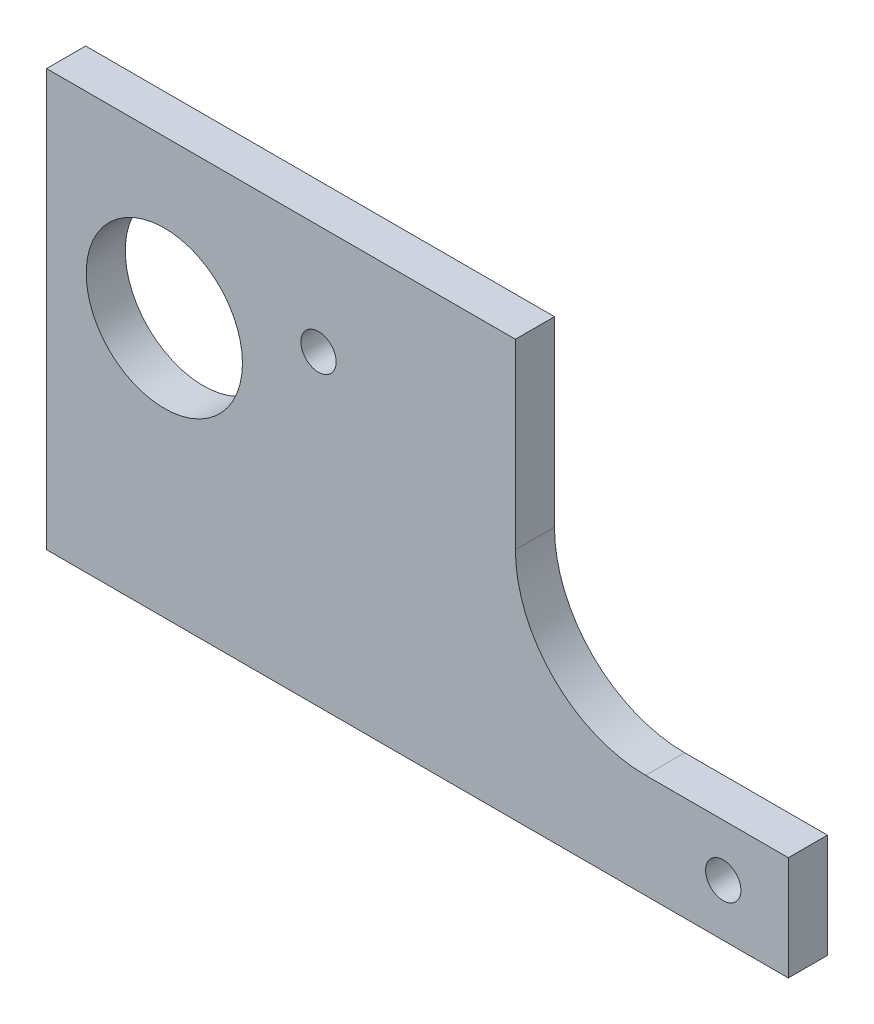
ISO-10303-21;
HEADER;
FILE_DESCRIPTION(('STEP AP214'),'2;1');
FILE_NAME('part.step','',(''),(''),'','','');
FILE_SCHEMA(('AUTOMOTIVE_DESIGN { 1 0 10303 214 1 1 1 1 }'));
ENDSEC;
DATA;
#1=APPLICATION_CONTEXT('core data for automotive mechanical design processes');
#2=APPLICATION_PROTOCOL_DEFINITION('international standard','automotive_design',2000,#1);
#3=PRODUCT_CONTEXT('',#1,'mechanical');
#4=PRODUCT('Part','Part','',(#3));
#5=PRODUCT_RELATED_PRODUCT_CATEGORY('part','',(#4));
#6=PRODUCT_DEFINITION_FORMATION('','',#4);
#7=PRODUCT_DEFINITION_CONTEXT('part definition',#1,'design');
#8=PRODUCT_DEFINITION('design','',#6,#7);
#9=PRODUCT_DEFINITION_SHAPE('','',#8);
#10=(LENGTH_UNIT() NAMED_UNIT(*) SI_UNIT(.MILLI.,.METRE.));
#11=(NAMED_UNIT(*) PLANE_ANGLE_UNIT() SI_UNIT($,.RADIAN.));
#12=(NAMED_UNIT(*) SI_UNIT($,.STERADIAN.) SOLID_ANGLE_UNIT());
#13=UNCERTAINTY_MEASURE_WITH_UNIT(LENGTH_MEASURE(1.E-05),#10,'distance_accuracy_value','');
#14=(GEOMETRIC_REPRESENTATION_CONTEXT(3) GLOBAL_UNCERTAINTY_ASSIGNED_CONTEXT((#13)) GLOBAL_UNIT_ASSIGNED_CONTEXT((#10,
#11,#12)) REPRESENTATION_CONTEXT('',''));
#15=CARTESIAN_POINT('',(0.,0.,0.));
#16=DIRECTION('',(0.,0.,1.));
#17=DIRECTION('',(1.,0.,0.));
#18=AXIS2_PLACEMENT_3D('',#15,#16,#17);
#19=CARTESIAN_POINT('',(93.599,-53.975,4.7625));
#20=DIRECTION('',(-1.,0.,0.));
#21=DIRECTION('',(0.,0.,1.));
#22=AXIS2_PLACEMENT_3D('',#19,#20,#21);
#23=PLANE('',#22);
#24=DIRECTION('',(0.,1.,0.));
#25=VECTOR('',#24,1.);
#26=CARTESIAN_POINT('',(93.599,-53.975,0.));
#27=LINE('',#26,#25);
#28=CARTESIAN_POINT('',(93.599,-53.975,0.));
#29=VERTEX_POINT('',#28);
#30=CARTESIAN_POINT('',(93.599,-41.275,0.));
#31=VERTEX_POINT('',#30);
#32=EDGE_CURVE('E122',#29,#31,#27,.T.);
#33=ORIENTED_EDGE('',*,*,#32,.T.);
#34=DIRECTION('',(0.,0.,-1.));
#35=VECTOR('',#34,1.);
#36=CARTESIAN_POINT('',(93.599,-41.275,4.7625));
#37=LINE('',#36,#35);
#38=CARTESIAN_POINT('',(93.599,-41.275,4.7625));
#39=VERTEX_POINT('',#38);
#40=EDGE_CURVE('E11',#39,#31,#37,.T.);
#41=ORIENTED_EDGE('',*,*,#40,.F.);
#42=DIRECTION('',(0.,1.,0.));
#43=VECTOR('',#42,1.);
#44=CARTESIAN_POINT('',(93.599,-53.975,4.7625));
#45=LINE('',#44,#43);
#46=CARTESIAN_POINT('',(93.599,-53.975,4.7625));
#47=VERTEX_POINT('',#46);
#48=EDGE_CURVE('E135',#47,#39,#45,.T.);
#49=ORIENTED_EDGE('',*,*,#48,.F.);
#50=DIRECTION('',(0.,0.,-1.));
#51=VECTOR('',#50,1.);
#52=CARTESIAN_POINT('',(93.599,-53.975,4.7625));
#53=LINE('',#52,#51);
#54=EDGE_CURVE('E118',#47,#29,#53,.T.);
#55=ORIENTED_EDGE('',*,*,#54,.T.);
#56=EDGE_LOOP('',(#33,#41,#49,#55));
#57=FACE_BOUND('',#56,.T.);
#58=ADVANCED_FACE('F32',(#57),#23,.F.);
#59=CARTESIAN_POINT('',(93.599,-41.275,4.7625));
#60=DIRECTION('',(0.,-1.,0.));
#61=DIRECTION('',(0.,0.,-1.));
#62=AXIS2_PLACEMENT_3D('',#59,#60,#61);
#63=PLANE('',#62);
#64=DIRECTION('',(-1.,0.,0.));
#65=VECTOR('',#64,1.);
#66=CARTESIAN_POINT('',(93.599,-41.275,0.));
#67=LINE('',#66,#65);
#68=CARTESIAN_POINT('',(76.2,-41.275,0.));
#69=VERTEX_POINT('',#68);
#70=EDGE_CURVE('E125',#31,#69,#67,.T.);
#71=ORIENTED_EDGE('',*,*,#70,.T.);
#72=DIRECTION('',(0.,0.,-1.));
#73=VECTOR('',#72,1.);
#74=CARTESIAN_POINT('',(76.2,-41.275,4.7625));
#75=LINE('',#74,#73);
#76=CARTESIAN_POINT('',(76.2,-41.275,4.7625));
#77=VERTEX_POINT('',#76);
#78=EDGE_CURVE('E40',#77,#69,#75,.T.);
#79=ORIENTED_EDGE('',*,*,#78,.F.);
#80=DIRECTION('',(-1.,0.,0.));
#81=VECTOR('',#80,1.);
#82=CARTESIAN_POINT('',(93.599,-41.275,4.7625));
#83=LINE('',#82,#81);
#84=EDGE_CURVE('E88',#39,#77,#83,.T.);
#85=ORIENTED_EDGE('',*,*,#84,.F.);
#86=ORIENTED_EDGE('',*,*,#40,.T.);
#87=EDGE_LOOP('',(#71,#79,#85,#86));
#88=FACE_BOUND('',#87,.T.);
#89=ADVANCED_FACE('F201',(#88),#63,.F.);
#90=CARTESIAN_POINT('',(76.2,-25.4,4.7625));
#91=DIRECTION('',(0.,0.,-1.));
#92=DIRECTION('',(-1.,0.,0.));
#93=AXIS2_PLACEMENT_3D('',#90,#91,#92);
#94=CYLINDRICAL_SURFACE('',#93,15.875);
#95=CARTESIAN_POINT('',(76.2,-25.4,0.));
#96=DIRECTION('',(0.,0.,-1.));
#97=DIRECTION('',(1.,0.,0.));
#98=AXIS2_PLACEMENT_3D('',#95,#96,#97);
#99=CIRCLE('',#98,15.875);
#100=CARTESIAN_POINT('',(60.325,-25.4,0.));
#101=VERTEX_POINT('',#100);
#102=EDGE_CURVE('E128',#69,#101,#99,.T.);
#103=ORIENTED_EDGE('',*,*,#102,.T.);
#104=DIRECTION('',(0.,0.,-1.));
#105=VECTOR('',#104,1.);
#106=CARTESIAN_POINT('',(60.325,-25.4,4.7625));
#107=LINE('',#106,#105);
#108=CARTESIAN_POINT('',(60.325,-25.4,4.7625));
#109=VERTEX_POINT('',#108);
#110=EDGE_CURVE('E139',#109,#101,#107,.T.);
#111=ORIENTED_EDGE('',*,*,#110,.F.);
#112=CARTESIAN_POINT('',(76.2,-25.4,4.7625));
#113=DIRECTION('',(0.,0.,-1.));
#114=DIRECTION('',(1.,0.,0.));
#115=AXIS2_PLACEMENT_3D('',#112,#113,#114);
#116=CIRCLE('',#115,15.875);
#117=EDGE_CURVE('E147',#77,#109,#116,.T.);
#118=ORIENTED_EDGE('',*,*,#117,.F.);
#119=ORIENTED_EDGE('',*,*,#78,.T.);
#120=EDGE_LOOP('',(#103,#111,#118,#119));
#121=FACE_BOUND('',#120,.T.);
#122=ADVANCED_FACE('F145',(#121),#94,.F.);
#123=CARTESIAN_POINT('',(60.325,-25.4,4.7625));
#124=DIRECTION('',(-1.,0.,0.));
#125=DIRECTION('',(0.,-1.,0.));
#126=AXIS2_PLACEMENT_3D('',#123,#124,#125);
#127=PLANE('',#126);
#128=DIRECTION('',(0.,1.,0.));
#129=VECTOR('',#128,1.);
#130=CARTESIAN_POINT('',(60.325,-25.4,0.));
#131=LINE('',#130,#129);
#132=CARTESIAN_POINT('',(60.325,-3.17499999999995,0.));
#133=VERTEX_POINT('',#132);
#134=EDGE_CURVE('E130',#101,#133,#131,.T.);
#135=ORIENTED_EDGE('',*,*,#134,.T.);
#136=DIRECTION('',(0.,0.,-1.));
#137=VECTOR('',#136,1.);
#138=CARTESIAN_POINT('',(60.325,-3.17499999999995,4.7625));
#139=LINE('',#138,#137);
#140=CARTESIAN_POINT('',(60.325,-3.17499999999995,4.7625));
#141=VERTEX_POINT('',#140);
#142=EDGE_CURVE('E113',#141,#133,#139,.T.);
#143=ORIENTED_EDGE('',*,*,#142,.F.);
#144=DIRECTION('',(0.,1.,0.));
#145=VECTOR('',#144,1.);
#146=CARTESIAN_POINT('',(60.325,-25.4,4.7625));
#147=LINE('',#146,#145);
#148=EDGE_CURVE('E104',#109,#141,#147,.T.);
#149=ORIENTED_EDGE('',*,*,#148,.F.);
#150=ORIENTED_EDGE('',*,*,#110,.T.);
#151=EDGE_LOOP('',(#135,#143,#149,#150));
#152=FACE_BOUND('',#151,.T.);
#153=ADVANCED_FACE('F153',(#152),#127,.F.);
#154=CARTESIAN_POINT('',(60.325,-3.17499999999995,4.7625));
#155=DIRECTION('',(0.,-1.,0.));
#156=DIRECTION('',(0.,0.,-1.));
#157=AXIS2_PLACEMENT_3D('',#154,#155,#156);
#158=PLANE('',#157);
#159=DIRECTION('',(-1.,0.,0.));
#160=VECTOR('',#159,1.);
#161=CARTESIAN_POINT('',(60.325,-3.17499999999995,0.));
#162=LINE('',#161,#160);
#163=CARTESIAN_POINT('',(3.175,-3.17499999999995,0.));
#164=VERTEX_POINT('',#163);
#165=EDGE_CURVE('E112',#133,#164,#162,.T.);
#166=ORIENTED_EDGE('',*,*,#165,.T.);
#167=DIRECTION('',(0.,0.,-1.));
#168=VECTOR('',#167,1.);
#169=CARTESIAN_POINT('',(3.175,-3.17499999999995,4.7625));
#170=LINE('',#169,#168);
#171=CARTESIAN_POINT('',(3.175,-3.17499999999995,4.7625));
#172=VERTEX_POINT('',#171);
#173=EDGE_CURVE('E109',#172,#164,#170,.T.);
#174=ORIENTED_EDGE('',*,*,#173,.F.);
#175=DIRECTION('',(-1.,0.,0.));
#176=VECTOR('',#175,1.);
#177=CARTESIAN_POINT('',(60.325,-3.17499999999995,4.7625));
#178=LINE('',#177,#176);
#179=EDGE_CURVE('E98',#141,#172,#178,.T.);
#180=ORIENTED_EDGE('',*,*,#179,.F.);
#181=ORIENTED_EDGE('',*,*,#142,.T.);
#182=EDGE_LOOP('',(#166,#174,#180,#181));
#183=FACE_BOUND('',#182,.T.);
#184=ADVANCED_FACE('F110',(#183),#158,.F.);
#185=CARTESIAN_POINT('',(3.175,-3.17499999999995,4.7625));
#186=DIRECTION('',(1.,0.,0.));
#187=DIRECTION('',(0.,0.,-1.));
#188=AXIS2_PLACEMENT_3D('',#185,#186,#187);
#189=PLANE('',#188);
#190=DIRECTION('',(0.,-1.,0.));
#191=VECTOR('',#190,1.);
#192=CARTESIAN_POINT('',(3.175,-3.17499999999995,0.));
#193=LINE('',#192,#191);
#194=CARTESIAN_POINT('',(3.175,-53.975,0.));
#195=VERTEX_POINT('',#194);
#196=EDGE_CURVE('E74',#164,#195,#193,.T.);
#197=ORIENTED_EDGE('',*,*,#196,.T.);
#198=DIRECTION('',(0.,0.,-1.));
#199=VECTOR('',#198,1.);
#200=CARTESIAN_POINT('',(3.175,-53.975,4.7625));
#201=LINE('',#200,#199);
#202=CARTESIAN_POINT('',(3.175,-53.975,4.7625));
#203=VERTEX_POINT('',#202);
#204=EDGE_CURVE('E114',#203,#195,#201,.T.);
#205=ORIENTED_EDGE('',*,*,#204,.F.);
#206=DIRECTION('',(0.,-1.,0.));
#207=VECTOR('',#206,1.);
#208=CARTESIAN_POINT('',(3.175,-3.17499999999995,4.7625));
#209=LINE('',#208,#207);
#210=EDGE_CURVE('E102',#172,#203,#209,.T.);
#211=ORIENTED_EDGE('',*,*,#210,.F.);
#212=ORIENTED_EDGE('',*,*,#173,.T.);
#213=EDGE_LOOP('',(#197,#205,#211,#212));
#214=FACE_BOUND('',#213,.T.);
#215=ADVANCED_FACE('F116',(#214),#189,.F.);
#216=CARTESIAN_POINT('',(3.175,-53.975,4.7625));
#217=DIRECTION('',(0.,1.,0.));
#218=DIRECTION('',(0.,0.,1.));
#219=AXIS2_PLACEMENT_3D('',#216,#217,#218);
#220=PLANE('',#219);
#221=DIRECTION('',(1.,0.,0.));
#222=VECTOR('',#221,1.);
#223=CARTESIAN_POINT('',(3.175,-53.975,0.));
#224=LINE('',#223,#222);
#225=EDGE_CURVE('E80',#195,#29,#224,.T.);
#226=ORIENTED_EDGE('',*,*,#225,.T.);
#227=ORIENTED_EDGE('',*,*,#54,.F.);
#228=DIRECTION('',(1.,0.,0.));
#229=VECTOR('',#228,1.);
#230=CARTESIAN_POINT('',(3.175,-53.975,4.7625));
#231=LINE('',#230,#229);
#232=EDGE_CURVE('E48',#203,#47,#231,.T.);
#233=ORIENTED_EDGE('',*,*,#232,.F.);
#234=ORIENTED_EDGE('',*,*,#204,.T.);
#235=EDGE_LOOP('',(#226,#227,#233,#234));
#236=FACE_BOUND('',#235,.T.);
#237=ADVANCED_FACE('F180',(#236),#220,.F.);
#238=CARTESIAN_POINT('',(76.2,-25.4,4.7625));
#239=DIRECTION('',(0.,0.,1.));
#240=DIRECTION('',(1.,0.,0.));
#241=AXIS2_PLACEMENT_3D('',#238,#239,#240);
#242=PLANE('',#241);
#243=CARTESIAN_POINT('',(36.322,-16.51,4.7625));
#244=DIRECTION('',(0.,0.,1.));
#245=DIRECTION('',(1.,0.,0.));
#246=AXIS2_PLACEMENT_3D('',#243,#244,#245);
#247=CIRCLE('',#246,2.15265);
#248=CARTESIAN_POINT('',(38.47465,-16.51,4.7625));
#249=VERTEX_POINT('',#248);
#250=EDGE_CURVE('E172',#249,#249,#247,.T.);
#251=ORIENTED_EDGE('',*,*,#250,.F.);
#252=EDGE_LOOP('',(#251));
#253=FACE_BOUND('',#252,.T.);
#254=CARTESIAN_POINT('',(85.6615,-47.625,4.7625));
#255=DIRECTION('',(0.,0.,1.));
#256=DIRECTION('',(1.,0.,0.));
#257=AXIS2_PLACEMENT_3D('',#254,#255,#256);
#258=CIRCLE('',#257,2.15264999999999);
#259=CARTESIAN_POINT('',(87.81415,-47.625,4.7625));
#260=VERTEX_POINT('',#259);
#261=EDGE_CURVE('E166',#260,#260,#258,.T.);
#262=ORIENTED_EDGE('',*,*,#261,.F.);
#263=EDGE_LOOP('',(#262));
#264=FACE_BOUND('',#263,.T.);
#265=CARTESIAN_POINT('',(17.526,-22.352,4.7625));
#266=DIRECTION('',(0.,0.,1.));
#267=DIRECTION('',(1.,0.,0.));
#268=AXIS2_PLACEMENT_3D('',#265,#266,#267);
#269=CIRCLE('',#268,9.525);
#270=CARTESIAN_POINT('',(27.051,-22.352,4.7625));
#271=VERTEX_POINT('',#270);
#272=EDGE_CURVE('E160',#271,#271,#269,.T.);
#273=ORIENTED_EDGE('',*,*,#272,.F.);
#274=EDGE_LOOP('',(#273));
#275=FACE_BOUND('',#274,.T.);
#276=ORIENTED_EDGE('',*,*,#48,.T.);
#277=ORIENTED_EDGE('',*,*,#84,.T.);
#278=ORIENTED_EDGE('',*,*,#117,.T.);
#279=ORIENTED_EDGE('',*,*,#148,.T.);
#280=ORIENTED_EDGE('',*,*,#179,.T.);
#281=ORIENTED_EDGE('',*,*,#210,.T.);
#282=ORIENTED_EDGE('',*,*,#232,.T.);
#283=EDGE_LOOP('',(#276,#277,#278,#279,#280,#281,#282));
#284=FACE_BOUND('',#283,.T.);
#285=ADVANCED_FACE('F100',(#253,#264,#275,#284),#242,.T.);
#286=CARTESIAN_POINT('',(76.2,-25.4,0.));
#287=DIRECTION('',(0.,0.,1.));
#288=DIRECTION('',(1.,0.,0.));
#289=AXIS2_PLACEMENT_3D('',#286,#287,#288);
#290=PLANE('',#289);
#291=CARTESIAN_POINT('',(36.322,-16.51,0.));
#292=DIRECTION('',(0.,0.,1.));
#293=DIRECTION('',(1.,0.,0.));
#294=AXIS2_PLACEMENT_3D('',#291,#292,#293);
#295=CIRCLE('',#294,2.15265);
#296=CARTESIAN_POINT('',(38.47465,-16.51,0.));
#297=VERTEX_POINT('',#296);
#298=EDGE_CURVE('E169',#297,#297,#295,.T.);
#299=ORIENTED_EDGE('',*,*,#298,.T.);
#300=EDGE_LOOP('',(#299));
#301=FACE_BOUND('',#300,.T.);
#302=CARTESIAN_POINT('',(85.6615,-47.625,0.));
#303=DIRECTION('',(0.,0.,1.));
#304=DIRECTION('',(1.,0.,0.));
#305=AXIS2_PLACEMENT_3D('',#302,#303,#304);
#306=CIRCLE('',#305,2.15264999999999);
#307=CARTESIAN_POINT('',(87.81415,-47.625,0.));
#308=VERTEX_POINT('',#307);
#309=EDGE_CURVE('E163',#308,#308,#306,.T.);
#310=ORIENTED_EDGE('',*,*,#309,.T.);
#311=EDGE_LOOP('',(#310));
#312=FACE_BOUND('',#311,.T.);
#313=CARTESIAN_POINT('',(17.526,-22.352,0.));
#314=DIRECTION('',(0.,0.,1.));
#315=DIRECTION('',(1.,0.,0.));
#316=AXIS2_PLACEMENT_3D('',#313,#314,#315);
#317=CIRCLE('',#316,9.525);
#318=CARTESIAN_POINT('',(27.051,-22.352,0.));
#319=VERTEX_POINT('',#318);
#320=EDGE_CURVE('E126',#319,#319,#317,.T.);
#321=ORIENTED_EDGE('',*,*,#320,.T.);
#322=EDGE_LOOP('',(#321));
#323=FACE_BOUND('',#322,.T.);
#324=ORIENTED_EDGE('',*,*,#32,.F.);
#325=ORIENTED_EDGE('',*,*,#225,.F.);
#326=ORIENTED_EDGE('',*,*,#196,.F.);
#327=ORIENTED_EDGE('',*,*,#165,.F.);
#328=ORIENTED_EDGE('',*,*,#134,.F.);
#329=ORIENTED_EDGE('',*,*,#102,.F.);
#330=ORIENTED_EDGE('',*,*,#70,.F.);
#331=EDGE_LOOP('',(#324,#325,#326,#327,#328,#329,#330));
#332=FACE_BOUND('',#331,.T.);
#333=ADVANCED_FACE('F151',(#301,#312,#323,#332),#290,.F.);
#334=CARTESIAN_POINT('',(17.526,-22.352,4.7625));
#335=DIRECTION('',(0.,0.,1.));
#336=DIRECTION('',(1.,0.,0.));
#337=AXIS2_PLACEMENT_3D('',#334,#335,#336);
#338=CYLINDRICAL_SURFACE('',#337,9.525);
#339=ORIENTED_EDGE('',*,*,#320,.F.);
#340=EDGE_LOOP('',(#339));
#341=FACE_BOUND('',#340,.T.);
#342=ORIENTED_EDGE('',*,*,#272,.T.);
#343=EDGE_LOOP('',(#342));
#344=FACE_BOUND('',#343,.T.);
#345=ADVANCED_FACE('F186',(#341,#344),#338,.F.);
#346=CARTESIAN_POINT('',(85.6615,-47.625,4.7625));
#347=DIRECTION('',(0.,0.,1.));
#348=DIRECTION('',(1.,0.,0.));
#349=AXIS2_PLACEMENT_3D('',#346,#347,#348);
#350=CYLINDRICAL_SURFACE('',#349,2.15264999999999);
#351=ORIENTED_EDGE('',*,*,#309,.F.);
#352=EDGE_LOOP('',(#351));
#353=FACE_BOUND('',#352,.T.);
#354=ORIENTED_EDGE('',*,*,#261,.T.);
#355=EDGE_LOOP('',(#354));
#356=FACE_BOUND('',#355,.T.);
#357=ADVANCED_FACE('F188',(#353,#356),#350,.F.);
#358=CARTESIAN_POINT('',(36.322,-16.51,4.7625));
#359=DIRECTION('',(0.,0.,1.));
#360=DIRECTION('',(1.,0.,0.));
#361=AXIS2_PLACEMENT_3D('',#358,#359,#360);
#362=CYLINDRICAL_SURFACE('',#361,2.15265);
#363=ORIENTED_EDGE('',*,*,#298,.F.);
#364=EDGE_LOOP('',(#363));
#365=FACE_BOUND('',#364,.T.);
#366=ORIENTED_EDGE('',*,*,#250,.T.);
#367=EDGE_LOOP('',(#366));
#368=FACE_BOUND('',#367,.T.);
#369=ADVANCED_FACE('F176',(#365,#368),#362,.F.);
#370=CLOSED_SHELL('',(#58,#89,#122,#153,#184,#215,#237,#285,#333,#345,#357,#369));
#371=MANIFOLD_SOLID_BREP('B2',#370);
#372=ADVANCED_BREP_SHAPE_REPRESENTATION('',(#18,#371),#14);
#373=SHAPE_DEFINITION_REPRESENTATION(#9,#372);
ENDSEC;
END-ISO-10303-21;
